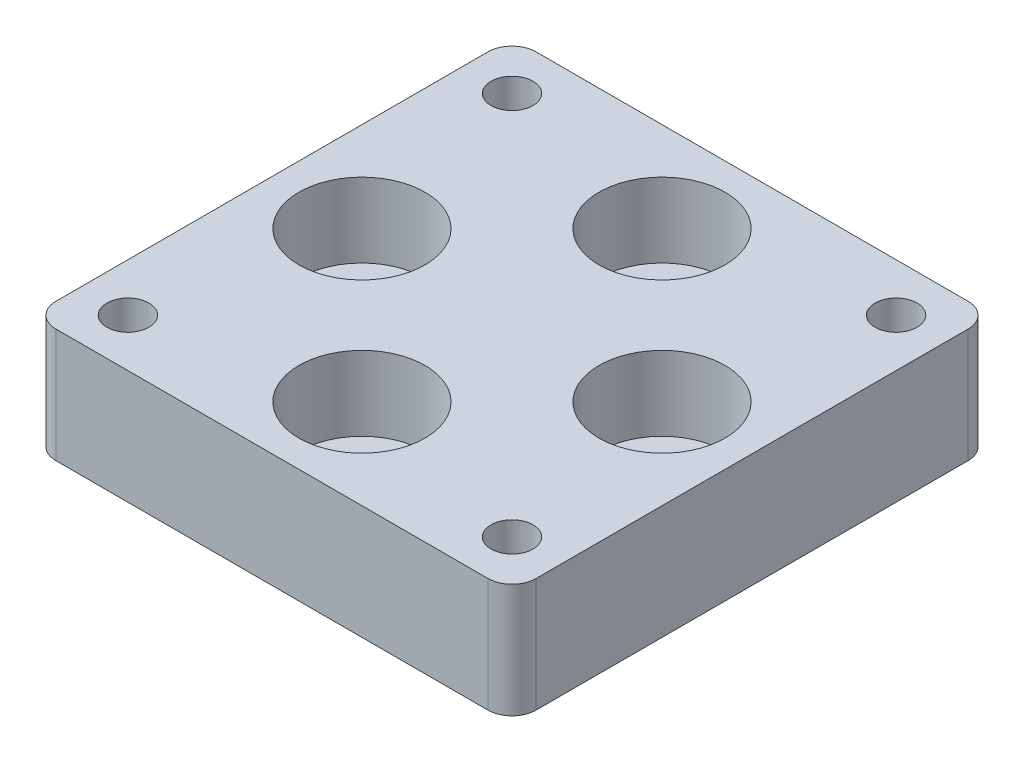
ISO-10303-21;
HEADER;
FILE_DESCRIPTION(('STEP AP214'),'2;1');
FILE_NAME('part.step','',(''),(''),'','','');
FILE_SCHEMA(('AUTOMOTIVE_DESIGN { 1 0 10303 214 1 1 1 1 }'));
ENDSEC;
DATA;
#1=APPLICATION_CONTEXT('core data for automotive mechanical design processes');
#2=APPLICATION_PROTOCOL_DEFINITION('international standard','automotive_design',2000,#1);
#3=PRODUCT_CONTEXT('',#1,'mechanical');
#4=PRODUCT('Part','Part','',(#3));
#5=PRODUCT_RELATED_PRODUCT_CATEGORY('part','',(#4));
#6=PRODUCT_DEFINITION_FORMATION('','',#4);
#7=PRODUCT_DEFINITION_CONTEXT('part definition',#1,'design');
#8=PRODUCT_DEFINITION('design','',#6,#7);
#9=PRODUCT_DEFINITION_SHAPE('','',#8);
#10=(LENGTH_UNIT() NAMED_UNIT(*) SI_UNIT(.MILLI.,.METRE.));
#11=(NAMED_UNIT(*) PLANE_ANGLE_UNIT() SI_UNIT($,.RADIAN.));
#12=(NAMED_UNIT(*) SI_UNIT($,.STERADIAN.) SOLID_ANGLE_UNIT());
#13=UNCERTAINTY_MEASURE_WITH_UNIT(LENGTH_MEASURE(1.E-05),#10,'distance_accuracy_value','');
#14=(GEOMETRIC_REPRESENTATION_CONTEXT(3) GLOBAL_UNCERTAINTY_ASSIGNED_CONTEXT((#13)) GLOBAL_UNIT_ASSIGNED_CONTEXT((#10,
#11,#12)) REPRESENTATION_CONTEXT('',''));
#15=CARTESIAN_POINT('',(0.,0.,0.));
#16=DIRECTION('',(0.,0.,1.));
#17=DIRECTION('',(1.,0.,0.));
#18=AXIS2_PLACEMENT_3D('',#15,#16,#17);
#19=CARTESIAN_POINT('',(-12.5,9.5,0.));
#20=DIRECTION('',(0.,-1.,0.));
#21=DIRECTION('',(0.,0.,-1.));
#22=AXIS2_PLACEMENT_3D('',#19,#20,#21);
#23=CYLINDRICAL_SURFACE('',#22,3.1);
#24=CARTESIAN_POINT('',(-12.5,0.,0.));
#25=DIRECTION('',(0.,1.,0.));
#26=DIRECTION('',(0.,0.,1.));
#27=AXIS2_PLACEMENT_3D('',#24,#25,#26);
#28=CIRCLE('',#27,3.1);
#29=CARTESIAN_POINT('',(-12.5,0.,3.1));
#30=VERTEX_POINT('',#29);
#31=EDGE_CURVE('E138',#30,#30,#28,.T.);
#32=ORIENTED_EDGE('',*,*,#31,.F.);
#33=EDGE_LOOP('',(#32));
#34=FACE_BOUND('',#33,.T.);
#35=CARTESIAN_POINT('',(-12.5,3.3,0.));
#36=DIRECTION('',(0.,1.,0.));
#37=DIRECTION('',(0.,0.,1.));
#38=AXIS2_PLACEMENT_3D('',#35,#36,#37);
#39=CIRCLE('',#38,3.1);
#40=CARTESIAN_POINT('',(-12.5,3.3,3.1));
#41=VERTEX_POINT('',#40);
#42=EDGE_CURVE('E41',#41,#41,#39,.T.);
#43=ORIENTED_EDGE('',*,*,#42,.T.);
#44=EDGE_LOOP('',(#43));
#45=FACE_BOUND('',#44,.T.);
#46=ADVANCED_FACE('F37',(#34,#45),#23,.F.);
#47=CARTESIAN_POINT('',(12.5,9.5,0.));
#48=DIRECTION('',(0.,-1.,0.));
#49=DIRECTION('',(0.,0.,-1.));
#50=AXIS2_PLACEMENT_3D('',#47,#48,#49);
#51=CYLINDRICAL_SURFACE('',#50,3.1);
#52=CARTESIAN_POINT('',(12.5,0.,0.));
#53=DIRECTION('',(0.,1.,0.));
#54=DIRECTION('',(0.,0.,-1.));
#55=AXIS2_PLACEMENT_3D('',#52,#53,#54);
#56=CIRCLE('',#55,3.1);
#57=CARTESIAN_POINT('',(12.5,0.,-3.1));
#58=VERTEX_POINT('',#57);
#59=EDGE_CURVE('E213',#58,#58,#56,.T.);
#60=ORIENTED_EDGE('',*,*,#59,.F.);
#61=EDGE_LOOP('',(#60));
#62=FACE_BOUND('',#61,.T.);
#63=CARTESIAN_POINT('',(12.5,3.3,0.));
#64=DIRECTION('',(0.,1.,0.));
#65=DIRECTION('',(0.,0.,1.));
#66=AXIS2_PLACEMENT_3D('',#63,#64,#65);
#67=CIRCLE('',#66,3.1);
#68=CARTESIAN_POINT('',(12.5,3.3,3.1));
#69=VERTEX_POINT('',#68);
#70=EDGE_CURVE('E172',#69,#69,#67,.T.);
#71=ORIENTED_EDGE('',*,*,#70,.T.);
#72=EDGE_LOOP('',(#71));
#73=FACE_BOUND('',#72,.T.);
#74=ADVANCED_FACE('F255',(#62,#73),#51,.F.);
#75=CARTESIAN_POINT('',(0.,9.5,-12.5));
#76=DIRECTION('',(0.,-1.,0.));
#77=DIRECTION('',(0.,0.,-1.));
#78=AXIS2_PLACEMENT_3D('',#75,#76,#77);
#79=CYLINDRICAL_SURFACE('',#78,3.1);
#80=CARTESIAN_POINT('',(0.,0.,-12.5));
#81=DIRECTION('',(0.,1.,0.));
#82=DIRECTION('',(0.,0.,1.));
#83=AXIS2_PLACEMENT_3D('',#80,#81,#82);
#84=CIRCLE('',#83,3.1);
#85=CARTESIAN_POINT('',(0.,0.,-9.4));
#86=VERTEX_POINT('',#85);
#87=EDGE_CURVE('E193',#86,#86,#84,.T.);
#88=ORIENTED_EDGE('',*,*,#87,.F.);
#89=EDGE_LOOP('',(#88));
#90=FACE_BOUND('',#89,.T.);
#91=CARTESIAN_POINT('',(0.,3.3,-12.5));
#92=DIRECTION('',(0.,1.,0.));
#93=DIRECTION('',(0.,0.,1.));
#94=AXIS2_PLACEMENT_3D('',#91,#92,#93);
#95=CIRCLE('',#94,3.1);
#96=CARTESIAN_POINT('',(0.,3.3,-9.4));
#97=VERTEX_POINT('',#96);
#98=EDGE_CURVE('E169',#97,#97,#95,.T.);
#99=ORIENTED_EDGE('',*,*,#98,.T.);
#100=EDGE_LOOP('',(#99));
#101=FACE_BOUND('',#100,.T.);
#102=ADVANCED_FACE('F261',(#90,#101),#79,.F.);
#103=CARTESIAN_POINT('',(0.,9.5,12.5));
#104=DIRECTION('',(0.,-1.,0.));
#105=DIRECTION('',(0.,0.,-1.));
#106=AXIS2_PLACEMENT_3D('',#103,#104,#105);
#107=CYLINDRICAL_SURFACE('',#106,3.1);
#108=CARTESIAN_POINT('',(0.,0.,12.5));
#109=DIRECTION('',(0.,1.,0.));
#110=DIRECTION('',(0.,0.,-1.));
#111=AXIS2_PLACEMENT_3D('',#108,#109,#110);
#112=CIRCLE('',#111,3.1);
#113=CARTESIAN_POINT('',(0.,0.,9.4));
#114=VERTEX_POINT('',#113);
#115=EDGE_CURVE('E177',#114,#114,#112,.T.);
#116=ORIENTED_EDGE('',*,*,#115,.F.);
#117=EDGE_LOOP('',(#116));
#118=FACE_BOUND('',#117,.T.);
#119=CARTESIAN_POINT('',(0.,3.3,12.5));
#120=DIRECTION('',(0.,1.,0.));
#121=DIRECTION('',(0.,0.,1.));
#122=AXIS2_PLACEMENT_3D('',#119,#120,#121);
#123=CIRCLE('',#122,3.1);
#124=CARTESIAN_POINT('',(0.,3.3,15.6));
#125=VERTEX_POINT('',#124);
#126=EDGE_CURVE('E166',#125,#125,#123,.T.);
#127=ORIENTED_EDGE('',*,*,#126,.T.);
#128=EDGE_LOOP('',(#127));
#129=FACE_BOUND('',#128,.T.);
#130=ADVANCED_FACE('F269',(#118,#129),#107,.F.);
#131=CARTESIAN_POINT('',(0.,9.5,0.));
#132=DIRECTION('',(0.,-1.,0.));
#133=DIRECTION('',(0.,0.,-1.));
#134=AXIS2_PLACEMENT_3D('',#131,#132,#133);
#135=PLANE('',#134);
#136=CARTESIAN_POINT('',(0.,9.5,-12.5));
#137=DIRECTION('',(0.,1.,0.));
#138=DIRECTION('',(0.,0.,1.));
#139=AXIS2_PLACEMENT_3D('',#136,#137,#138);
#140=CIRCLE('',#139,5.25);
#141=CARTESIAN_POINT('',(0.,9.5,-7.25));
#142=VERTEX_POINT('',#141);
#143=EDGE_CURVE('E455',#142,#142,#140,.T.);
#144=ORIENTED_EDGE('',*,*,#143,.F.);
#145=EDGE_LOOP('',(#144));
#146=FACE_BOUND('',#145,.T.);
#147=CARTESIAN_POINT('',(12.5,9.5,0.));
#148=DIRECTION('',(0.,1.,0.));
#149=DIRECTION('',(0.,0.,1.));
#150=AXIS2_PLACEMENT_3D('',#147,#148,#149);
#151=CIRCLE('',#150,5.25);
#152=CARTESIAN_POINT('',(12.5,9.5,5.25));
#153=VERTEX_POINT('',#152);
#154=EDGE_CURVE('E463',#153,#153,#151,.T.);
#155=ORIENTED_EDGE('',*,*,#154,.F.);
#156=EDGE_LOOP('',(#155));
#157=FACE_BOUND('',#156,.T.);
#158=CARTESIAN_POINT('',(0.,9.5,12.5));
#159=DIRECTION('',(0.,1.,0.));
#160=DIRECTION('',(0.,0.,1.));
#161=AXIS2_PLACEMENT_3D('',#158,#159,#160);
#162=CIRCLE('',#161,5.25);
#163=CARTESIAN_POINT('',(0.,9.5,17.75));
#164=VERTEX_POINT('',#163);
#165=EDGE_CURVE('E469',#164,#164,#162,.T.);
#166=ORIENTED_EDGE('',*,*,#165,.F.);
#167=EDGE_LOOP('',(#166));
#168=FACE_BOUND('',#167,.T.);
#169=CARTESIAN_POINT('',(-12.5,9.5,0.));
#170=DIRECTION('',(0.,1.,0.));
#171=DIRECTION('',(0.,0.,1.));
#172=AXIS2_PLACEMENT_3D('',#169,#170,#171);
#173=CIRCLE('',#172,5.25);
#174=CARTESIAN_POINT('',(-12.5,9.5,5.25));
#175=VERTEX_POINT('',#174);
#176=EDGE_CURVE('E190',#175,#175,#173,.T.);
#177=ORIENTED_EDGE('',*,*,#176,.F.);
#178=EDGE_LOOP('',(#177));
#179=FACE_BOUND('',#178,.T.);
#180=DIRECTION('',(0.,0.,-1.));
#181=VECTOR('',#180,1.);
#182=CARTESIAN_POINT('',(20.,9.5,20.));
#183=LINE('',#182,#181);
#184=CARTESIAN_POINT('',(20.,9.5,18.));
#185=VERTEX_POINT('',#184);
#186=CARTESIAN_POINT('',(20.,9.5,-18.));
#187=VERTEX_POINT('',#186);
#188=EDGE_CURVE('E143',#185,#187,#183,.T.);
#189=ORIENTED_EDGE('',*,*,#188,.T.);
#190=CARTESIAN_POINT('',(18.,9.5,-18.));
#191=DIRECTION('',(0.,-1.,0.));
#192=DIRECTION('',(0.,0.,-1.));
#193=AXIS2_PLACEMENT_3D('',#190,#191,#192);
#194=CIRCLE('',#193,2.);
#195=CARTESIAN_POINT('',(18.,9.5,-20.));
#196=VERTEX_POINT('',#195);
#197=EDGE_CURVE('E158',#187,#196,#194,.F.);
#198=ORIENTED_EDGE('',*,*,#197,.T.);
#199=DIRECTION('',(-1.,0.,0.));
#200=VECTOR('',#199,1.);
#201=CARTESIAN_POINT('',(-20.,9.5,-20.));
#202=LINE('',#201,#200);
#203=CARTESIAN_POINT('',(-18.,9.5,-20.));
#204=VERTEX_POINT('',#203);
#205=EDGE_CURVE('E125',#196,#204,#202,.T.);
#206=ORIENTED_EDGE('',*,*,#205,.T.);
#207=CARTESIAN_POINT('',(-18.,9.5,-18.));
#208=DIRECTION('',(0.,-1.,0.));
#209=DIRECTION('',(0.,0.,-1.));
#210=AXIS2_PLACEMENT_3D('',#207,#208,#209);
#211=CIRCLE('',#210,2.);
#212=CARTESIAN_POINT('',(-20.,9.5,-18.));
#213=VERTEX_POINT('',#212);
#214=EDGE_CURVE('E153',#204,#213,#211,.F.);
#215=ORIENTED_EDGE('',*,*,#214,.T.);
#216=DIRECTION('',(0.,0.,1.));
#217=VECTOR('',#216,1.);
#218=CARTESIAN_POINT('',(-20.,9.5,20.));
#219=LINE('',#218,#217);
#220=CARTESIAN_POINT('',(-20.,9.5,18.));
#221=VERTEX_POINT('',#220);
#222=EDGE_CURVE('E223',#213,#221,#219,.T.);
#223=ORIENTED_EDGE('',*,*,#222,.T.);
#224=CARTESIAN_POINT('',(-18.,9.5,18.));
#225=DIRECTION('',(0.,-1.,0.));
#226=DIRECTION('',(0.,0.,-1.));
#227=AXIS2_PLACEMENT_3D('',#224,#225,#226);
#228=CIRCLE('',#227,2.);
#229=CARTESIAN_POINT('',(-18.,9.5,20.));
#230=VERTEX_POINT('',#229);
#231=EDGE_CURVE('E61',#221,#230,#228,.F.);
#232=ORIENTED_EDGE('',*,*,#231,.T.);
#233=DIRECTION('',(1.,0.,0.));
#234=VECTOR('',#233,1.);
#235=CARTESIAN_POINT('',(-20.,9.5,20.));
#236=LINE('',#235,#234);
#237=CARTESIAN_POINT('',(18.,9.5,20.));
#238=VERTEX_POINT('',#237);
#239=EDGE_CURVE('E144',#230,#238,#236,.T.);
#240=ORIENTED_EDGE('',*,*,#239,.T.);
#241=CARTESIAN_POINT('',(18.,9.5,18.));
#242=DIRECTION('',(0.,-1.,0.));
#243=DIRECTION('',(0.,0.,-1.));
#244=AXIS2_PLACEMENT_3D('',#241,#242,#243);
#245=CIRCLE('',#244,2.);
#246=EDGE_CURVE('E156',#238,#185,#245,.F.);
#247=ORIENTED_EDGE('',*,*,#246,.T.);
#248=EDGE_LOOP('',(#189,#198,#206,#215,#223,#232,#240,#247));
#249=FACE_BOUND('',#248,.T.);
#250=CARTESIAN_POINT('',(-16.,9.5,-16.));
#251=DIRECTION('',(0.,1.,0.));
#252=DIRECTION('',(0.,0.,1.));
#253=AXIS2_PLACEMENT_3D('',#250,#251,#252);
#254=CIRCLE('',#253,1.75);
#255=CARTESIAN_POINT('',(-16.,9.5,-14.25));
#256=VERTEX_POINT('',#255);
#257=EDGE_CURVE('E210',#256,#256,#254,.T.);
#258=ORIENTED_EDGE('',*,*,#257,.F.);
#259=EDGE_LOOP('',(#258));
#260=FACE_BOUND('',#259,.T.);
#261=CARTESIAN_POINT('',(16.,9.5,-16.));
#262=DIRECTION('',(0.,1.,0.));
#263=DIRECTION('',(0.,0.,1.));
#264=AXIS2_PLACEMENT_3D('',#261,#262,#263);
#265=CIRCLE('',#264,1.75);
#266=CARTESIAN_POINT('',(16.,9.5,-14.25));
#267=VERTEX_POINT('',#266);
#268=EDGE_CURVE('E204',#267,#267,#265,.T.);
#269=ORIENTED_EDGE('',*,*,#268,.F.);
#270=EDGE_LOOP('',(#269));
#271=FACE_BOUND('',#270,.T.);
#272=CARTESIAN_POINT('',(-16.,9.5,16.));
#273=DIRECTION('',(0.,1.,0.));
#274=DIRECTION('',(0.,0.,1.));
#275=AXIS2_PLACEMENT_3D('',#272,#273,#274);
#276=CIRCLE('',#275,1.75);
#277=CARTESIAN_POINT('',(-16.,9.5,17.75));
#278=VERTEX_POINT('',#277);
#279=EDGE_CURVE('E198',#278,#278,#276,.T.);
#280=ORIENTED_EDGE('',*,*,#279,.F.);
#281=EDGE_LOOP('',(#280));
#282=FACE_BOUND('',#281,.T.);
#283=CARTESIAN_POINT('',(16.,9.5,16.));
#284=DIRECTION('',(0.,1.,0.));
#285=DIRECTION('',(0.,0.,1.));
#286=AXIS2_PLACEMENT_3D('',#283,#284,#285);
#287=CIRCLE('',#286,1.75);
#288=CARTESIAN_POINT('',(16.,9.5,17.75));
#289=VERTEX_POINT('',#288);
#290=EDGE_CURVE('E186',#289,#289,#287,.T.);
#291=ORIENTED_EDGE('',*,*,#290,.F.);
#292=EDGE_LOOP('',(#291));
#293=FACE_BOUND('',#292,.T.);
#294=ADVANCED_FACE('F225',(#146,#157,#168,#179,#249,#260,#271,#282,#293),#135,.F.);
#295=CARTESIAN_POINT('',(0.,0.,0.));
#296=DIRECTION('',(0.,-1.,0.));
#297=DIRECTION('',(0.,0.,-1.));
#298=AXIS2_PLACEMENT_3D('',#295,#296,#297);
#299=PLANE('',#298);
#300=CARTESIAN_POINT('',(16.,0.,16.));
#301=DIRECTION('',(0.,1.,0.));
#302=DIRECTION('',(0.,0.,1.));
#303=AXIS2_PLACEMENT_3D('',#300,#301,#302);
#304=CIRCLE('',#303,1.75);
#305=CARTESIAN_POINT('',(16.,0.,17.75));
#306=VERTEX_POINT('',#305);
#307=EDGE_CURVE('E181',#306,#306,#304,.T.);
#308=ORIENTED_EDGE('',*,*,#307,.T.);
#309=EDGE_LOOP('',(#308));
#310=FACE_BOUND('',#309,.T.);
#311=CARTESIAN_POINT('',(-16.,0.,16.));
#312=DIRECTION('',(0.,1.,0.));
#313=DIRECTION('',(0.,0.,1.));
#314=AXIS2_PLACEMENT_3D('',#311,#312,#313);
#315=CIRCLE('',#314,1.75);
#316=CARTESIAN_POINT('',(-16.,0.,17.75));
#317=VERTEX_POINT('',#316);
#318=EDGE_CURVE('E197',#317,#317,#315,.T.);
#319=ORIENTED_EDGE('',*,*,#318,.T.);
#320=EDGE_LOOP('',(#319));
#321=FACE_BOUND('',#320,.T.);
#322=CARTESIAN_POINT('',(-16.,0.,-16.));
#323=DIRECTION('',(0.,1.,0.));
#324=DIRECTION('',(0.,0.,1.));
#325=AXIS2_PLACEMENT_3D('',#322,#323,#324);
#326=CIRCLE('',#325,1.75);
#327=CARTESIAN_POINT('',(-16.,0.,-14.25));
#328=VERTEX_POINT('',#327);
#329=EDGE_CURVE('E207',#328,#328,#326,.T.);
#330=ORIENTED_EDGE('',*,*,#329,.T.);
#331=EDGE_LOOP('',(#330));
#332=FACE_BOUND('',#331,.T.);
#333=ORIENTED_EDGE('',*,*,#31,.T.);
#334=EDGE_LOOP('',(#333));
#335=FACE_BOUND('',#334,.T.);
#336=DIRECTION('',(-1.,0.,0.));
#337=VECTOR('',#336,1.);
#338=CARTESIAN_POINT('',(-20.,0.,-20.));
#339=LINE('',#338,#337);
#340=CARTESIAN_POINT('',(18.,0.,-20.));
#341=VERTEX_POINT('',#340);
#342=CARTESIAN_POINT('',(-18.,0.,-20.));
#343=VERTEX_POINT('',#342);
#344=EDGE_CURVE('E122',#341,#343,#339,.T.);
#345=ORIENTED_EDGE('',*,*,#344,.F.);
#346=CARTESIAN_POINT('',(18.,0.,-18.));
#347=DIRECTION('',(0.,-1.,0.));
#348=DIRECTION('',(0.,0.,-1.));
#349=AXIS2_PLACEMENT_3D('',#346,#347,#348);
#350=CIRCLE('',#349,2.);
#351=CARTESIAN_POINT('',(20.,0.,-18.));
#352=VERTEX_POINT('',#351);
#353=EDGE_CURVE('E105',#341,#352,#350,.T.);
#354=ORIENTED_EDGE('',*,*,#353,.T.);
#355=DIRECTION('',(0.,0.,-1.));
#356=VECTOR('',#355,1.);
#357=CARTESIAN_POINT('',(20.,0.,20.));
#358=LINE('',#357,#356);
#359=CARTESIAN_POINT('',(20.,0.,18.));
#360=VERTEX_POINT('',#359);
#361=EDGE_CURVE('E133',#360,#352,#358,.T.);
#362=ORIENTED_EDGE('',*,*,#361,.F.);
#363=CARTESIAN_POINT('',(18.,0.,18.));
#364=DIRECTION('',(0.,-1.,0.));
#365=DIRECTION('',(0.,0.,-1.));
#366=AXIS2_PLACEMENT_3D('',#363,#364,#365);
#367=CIRCLE('',#366,2.);
#368=CARTESIAN_POINT('',(18.,0.,20.));
#369=VERTEX_POINT('',#368);
#370=EDGE_CURVE('E116',#360,#369,#367,.T.);
#371=ORIENTED_EDGE('',*,*,#370,.T.);
#372=DIRECTION('',(1.,0.,0.));
#373=VECTOR('',#372,1.);
#374=CARTESIAN_POINT('',(-20.,0.,20.));
#375=LINE('',#374,#373);
#376=CARTESIAN_POINT('',(-18.,0.,20.));
#377=VERTEX_POINT('',#376);
#378=EDGE_CURVE('E136',#377,#369,#375,.T.);
#379=ORIENTED_EDGE('',*,*,#378,.F.);
#380=CARTESIAN_POINT('',(-18.,0.,18.));
#381=DIRECTION('',(0.,-1.,0.));
#382=DIRECTION('',(0.,0.,-1.));
#383=AXIS2_PLACEMENT_3D('',#380,#381,#382);
#384=CIRCLE('',#383,2.);
#385=CARTESIAN_POINT('',(-20.,0.,18.));
#386=VERTEX_POINT('',#385);
#387=EDGE_CURVE('E147',#377,#386,#384,.T.);
#388=ORIENTED_EDGE('',*,*,#387,.T.);
#389=DIRECTION('',(0.,0.,1.));
#390=VECTOR('',#389,1.);
#391=CARTESIAN_POINT('',(-20.,0.,20.));
#392=LINE('',#391,#390);
#393=CARTESIAN_POINT('',(-20.,0.,-18.));
#394=VERTEX_POINT('',#393);
#395=EDGE_CURVE('E132',#394,#386,#392,.T.);
#396=ORIENTED_EDGE('',*,*,#395,.F.);
#397=CARTESIAN_POINT('',(-18.,0.,-18.));
#398=DIRECTION('',(0.,-1.,0.));
#399=DIRECTION('',(0.,0.,-1.));
#400=AXIS2_PLACEMENT_3D('',#397,#398,#399);
#401=CIRCLE('',#400,2.);
#402=EDGE_CURVE('E126',#394,#343,#401,.T.);
#403=ORIENTED_EDGE('',*,*,#402,.T.);
#404=EDGE_LOOP('',(#345,#354,#362,#371,#379,#388,#396,#403));
#405=FACE_BOUND('',#404,.T.);
#406=ORIENTED_EDGE('',*,*,#59,.T.);
#407=EDGE_LOOP('',(#406));
#408=FACE_BOUND('',#407,.T.);
#409=CARTESIAN_POINT('',(16.,0.,-16.));
#410=DIRECTION('',(0.,1.,0.));
#411=DIRECTION('',(0.,0.,1.));
#412=AXIS2_PLACEMENT_3D('',#409,#410,#411);
#413=CIRCLE('',#412,1.75);
#414=CARTESIAN_POINT('',(16.,0.,-14.25));
#415=VERTEX_POINT('',#414);
#416=EDGE_CURVE('E201',#415,#415,#413,.T.);
#417=ORIENTED_EDGE('',*,*,#416,.T.);
#418=EDGE_LOOP('',(#417));
#419=FACE_BOUND('',#418,.T.);
#420=ORIENTED_EDGE('',*,*,#87,.T.);
#421=EDGE_LOOP('',(#420));
#422=FACE_BOUND('',#421,.T.);
#423=ORIENTED_EDGE('',*,*,#115,.T.);
#424=EDGE_LOOP('',(#423));
#425=FACE_BOUND('',#424,.T.);
#426=ADVANCED_FACE('F129',(#310,#321,#332,#335,#405,#408,#419,#422,#425),#299,.T.);
#427=CARTESIAN_POINT('',(20.,9.5,20.));
#428=DIRECTION('',(-1.,0.,0.));
#429=DIRECTION('',(0.,0.,1.));
#430=AXIS2_PLACEMENT_3D('',#427,#428,#429);
#431=PLANE('',#430);
#432=ORIENTED_EDGE('',*,*,#361,.T.);
#433=DIRECTION('',(0.,-1.,0.));
#434=VECTOR('',#433,1.);
#435=CARTESIAN_POINT('',(20.,9.5,-18.));
#436=LINE('',#435,#434);
#437=EDGE_CURVE('E110',#352,#187,#436,.F.);
#438=ORIENTED_EDGE('',*,*,#437,.T.);
#439=ORIENTED_EDGE('',*,*,#188,.F.);
#440=DIRECTION('',(0.,-1.,0.));
#441=VECTOR('',#440,1.);
#442=CARTESIAN_POINT('',(20.,9.5,18.));
#443=LINE('',#442,#441);
#444=EDGE_CURVE('E115',#185,#360,#443,.T.);
#445=ORIENTED_EDGE('',*,*,#444,.T.);
#446=EDGE_LOOP('',(#432,#438,#439,#445));
#447=FACE_BOUND('',#446,.T.);
#448=ADVANCED_FACE('F233',(#447),#431,.F.);
#449=CARTESIAN_POINT('',(-20.,9.5,-20.));
#450=DIRECTION('',(0.,0.,1.));
#451=DIRECTION('',(1.,0.,0.));
#452=AXIS2_PLACEMENT_3D('',#449,#450,#451);
#453=PLANE('',#452);
#454=ORIENTED_EDGE('',*,*,#205,.F.);
#455=DIRECTION('',(0.,-1.,0.));
#456=VECTOR('',#455,1.);
#457=CARTESIAN_POINT('',(18.,9.5,-20.));
#458=LINE('',#457,#456);
#459=EDGE_CURVE('E109',#196,#341,#458,.T.);
#460=ORIENTED_EDGE('',*,*,#459,.T.);
#461=ORIENTED_EDGE('',*,*,#344,.T.);
#462=DIRECTION('',(0.,-1.,0.));
#463=VECTOR('',#462,1.);
#464=CARTESIAN_POINT('',(-18.,9.5,-20.));
#465=LINE('',#464,#463);
#466=EDGE_CURVE('E127',#343,#204,#465,.F.);
#467=ORIENTED_EDGE('',*,*,#466,.T.);
#468=EDGE_LOOP('',(#454,#460,#461,#467));
#469=FACE_BOUND('',#468,.T.);
#470=ADVANCED_FACE('F121',(#469),#453,.F.);
#471=CARTESIAN_POINT('',(-20.,9.5,20.));
#472=DIRECTION('',(1.,0.,0.));
#473=DIRECTION('',(0.,0.,-1.));
#474=AXIS2_PLACEMENT_3D('',#471,#472,#473);
#475=PLANE('',#474);
#476=ORIENTED_EDGE('',*,*,#395,.T.);
#477=DIRECTION('',(0.,-1.,0.));
#478=VECTOR('',#477,1.);
#479=CARTESIAN_POINT('',(-20.,9.5,18.));
#480=LINE('',#479,#478);
#481=EDGE_CURVE('E11',#386,#221,#480,.F.);
#482=ORIENTED_EDGE('',*,*,#481,.T.);
#483=ORIENTED_EDGE('',*,*,#222,.F.);
#484=DIRECTION('',(0.,-1.,0.));
#485=VECTOR('',#484,1.);
#486=CARTESIAN_POINT('',(-20.,9.5,-18.));
#487=LINE('',#486,#485);
#488=EDGE_CURVE('E46',#213,#394,#487,.T.);
#489=ORIENTED_EDGE('',*,*,#488,.T.);
#490=EDGE_LOOP('',(#476,#482,#483,#489));
#491=FACE_BOUND('',#490,.T.);
#492=ADVANCED_FACE('F240',(#491),#475,.F.);
#493=CARTESIAN_POINT('',(-20.,9.5,20.));
#494=DIRECTION('',(0.,0.,-1.));
#495=DIRECTION('',(-1.,0.,0.));
#496=AXIS2_PLACEMENT_3D('',#493,#494,#495);
#497=PLANE('',#496);
#498=ORIENTED_EDGE('',*,*,#378,.T.);
#499=DIRECTION('',(0.,-1.,0.));
#500=VECTOR('',#499,1.);
#501=CARTESIAN_POINT('',(18.,9.5,20.));
#502=LINE('',#501,#500);
#503=EDGE_CURVE('E54',#369,#238,#502,.F.);
#504=ORIENTED_EDGE('',*,*,#503,.T.);
#505=ORIENTED_EDGE('',*,*,#239,.F.);
#506=DIRECTION('',(0.,-1.,0.));
#507=VECTOR('',#506,1.);
#508=CARTESIAN_POINT('',(-18.,9.5,20.));
#509=LINE('',#508,#507);
#510=EDGE_CURVE('E160',#230,#377,#509,.T.);
#511=ORIENTED_EDGE('',*,*,#510,.T.);
#512=EDGE_LOOP('',(#498,#504,#505,#511));
#513=FACE_BOUND('',#512,.T.);
#514=ADVANCED_FACE('F235',(#513),#497,.F.);
#515=CARTESIAN_POINT('',(-16.,9.5,-16.));
#516=DIRECTION('',(0.,-1.,0.));
#517=DIRECTION('',(0.,0.,-1.));
#518=AXIS2_PLACEMENT_3D('',#515,#516,#517);
#519=CYLINDRICAL_SURFACE('',#518,1.75);
#520=ORIENTED_EDGE('',*,*,#257,.T.);
#521=EDGE_LOOP('',(#520));
#522=FACE_BOUND('',#521,.T.);
#523=ORIENTED_EDGE('',*,*,#329,.F.);
#524=EDGE_LOOP('',(#523));
#525=FACE_BOUND('',#524,.T.);
#526=ADVANCED_FACE('F276',(#522,#525),#519,.F.);
#527=CARTESIAN_POINT('',(16.,9.5,-16.));
#528=DIRECTION('',(0.,-1.,0.));
#529=DIRECTION('',(0.,0.,-1.));
#530=AXIS2_PLACEMENT_3D('',#527,#528,#529);
#531=CYLINDRICAL_SURFACE('',#530,1.75);
#532=ORIENTED_EDGE('',*,*,#268,.T.);
#533=EDGE_LOOP('',(#532));
#534=FACE_BOUND('',#533,.T.);
#535=ORIENTED_EDGE('',*,*,#416,.F.);
#536=EDGE_LOOP('',(#535));
#537=FACE_BOUND('',#536,.T.);
#538=ADVANCED_FACE('F421',(#534,#537),#531,.F.);
#539=CARTESIAN_POINT('',(-16.,9.5,16.));
#540=DIRECTION('',(0.,-1.,0.));
#541=DIRECTION('',(0.,0.,-1.));
#542=AXIS2_PLACEMENT_3D('',#539,#540,#541);
#543=CYLINDRICAL_SURFACE('',#542,1.75);
#544=ORIENTED_EDGE('',*,*,#279,.T.);
#545=EDGE_LOOP('',(#544));
#546=FACE_BOUND('',#545,.T.);
#547=ORIENTED_EDGE('',*,*,#318,.F.);
#548=EDGE_LOOP('',(#547));
#549=FACE_BOUND('',#548,.T.);
#550=ADVANCED_FACE('F416',(#546,#549),#543,.F.);
#551=CARTESIAN_POINT('',(16.,9.5,16.));
#552=DIRECTION('',(0.,-1.,0.));
#553=DIRECTION('',(0.,0.,-1.));
#554=AXIS2_PLACEMENT_3D('',#551,#552,#553);
#555=CYLINDRICAL_SURFACE('',#554,1.75);
#556=ORIENTED_EDGE('',*,*,#290,.T.);
#557=EDGE_LOOP('',(#556));
#558=FACE_BOUND('',#557,.T.);
#559=ORIENTED_EDGE('',*,*,#307,.F.);
#560=EDGE_LOOP('',(#559));
#561=FACE_BOUND('',#560,.T.);
#562=ADVANCED_FACE('F285',(#558,#561),#555,.F.);
#563=CARTESIAN_POINT('',(18.,9.5,-18.));
#564=DIRECTION('',(0.,-1.,0.));
#565=DIRECTION('',(0.,0.,-1.));
#566=AXIS2_PLACEMENT_3D('',#563,#564,#565);
#567=CYLINDRICAL_SURFACE('',#566,2.);
#568=ORIENTED_EDGE('',*,*,#197,.F.);
#569=ORIENTED_EDGE('',*,*,#437,.F.);
#570=ORIENTED_EDGE('',*,*,#353,.F.);
#571=ORIENTED_EDGE('',*,*,#459,.F.);
#572=EDGE_LOOP('',(#568,#569,#570,#571));
#573=FACE_BOUND('',#572,.T.);
#574=ADVANCED_FACE('F108',(#573),#567,.T.);
#575=CARTESIAN_POINT('',(18.,9.5,18.));
#576=DIRECTION('',(0.,-1.,0.));
#577=DIRECTION('',(0.,0.,-1.));
#578=AXIS2_PLACEMENT_3D('',#575,#576,#577);
#579=CYLINDRICAL_SURFACE('',#578,2.);
#580=ORIENTED_EDGE('',*,*,#246,.F.);
#581=ORIENTED_EDGE('',*,*,#503,.F.);
#582=ORIENTED_EDGE('',*,*,#370,.F.);
#583=ORIENTED_EDGE('',*,*,#444,.F.);
#584=EDGE_LOOP('',(#580,#581,#582,#583));
#585=FACE_BOUND('',#584,.T.);
#586=ADVANCED_FACE('F231',(#585),#579,.T.);
#587=CARTESIAN_POINT('',(-18.,9.5,18.));
#588=DIRECTION('',(0.,-1.,0.));
#589=DIRECTION('',(0.,0.,-1.));
#590=AXIS2_PLACEMENT_3D('',#587,#588,#589);
#591=CYLINDRICAL_SURFACE('',#590,2.);
#592=ORIENTED_EDGE('',*,*,#231,.F.);
#593=ORIENTED_EDGE('',*,*,#481,.F.);
#594=ORIENTED_EDGE('',*,*,#387,.F.);
#595=ORIENTED_EDGE('',*,*,#510,.F.);
#596=EDGE_LOOP('',(#592,#593,#594,#595));
#597=FACE_BOUND('',#596,.T.);
#598=ADVANCED_FACE('F237',(#597),#591,.T.);
#599=CARTESIAN_POINT('',(-18.,9.5,-18.));
#600=DIRECTION('',(0.,-1.,0.));
#601=DIRECTION('',(0.,0.,-1.));
#602=AXIS2_PLACEMENT_3D('',#599,#600,#601);
#603=CYLINDRICAL_SURFACE('',#602,2.);
#604=ORIENTED_EDGE('',*,*,#214,.F.);
#605=ORIENTED_EDGE('',*,*,#466,.F.);
#606=ORIENTED_EDGE('',*,*,#402,.F.);
#607=ORIENTED_EDGE('',*,*,#488,.F.);
#608=EDGE_LOOP('',(#604,#605,#606,#607));
#609=FACE_BOUND('',#608,.T.);
#610=ADVANCED_FACE('F39',(#609),#603,.T.);
#611=CARTESIAN_POINT('',(0.,3.3,12.5));
#612=DIRECTION('',(0.,1.,0.));
#613=DIRECTION('',(0.,0.,1.));
#614=AXIS2_PLACEMENT_3D('',#611,#612,#613);
#615=CYLINDRICAL_SURFACE('',#614,5.25);
#616=CARTESIAN_POINT('',(0.,3.3,12.5));
#617=DIRECTION('',(0.,1.,0.));
#618=DIRECTION('',(0.,0.,1.));
#619=AXIS2_PLACEMENT_3D('',#616,#617,#618);
#620=CIRCLE('',#619,5.25);
#621=CARTESIAN_POINT('',(0.,3.3,17.75));
#622=VERTEX_POINT('',#621);
#623=EDGE_CURVE('E466',#622,#622,#620,.T.);
#624=ORIENTED_EDGE('',*,*,#623,.F.);
#625=EDGE_LOOP('',(#624));
#626=FACE_BOUND('',#625,.T.);
#627=ORIENTED_EDGE('',*,*,#165,.T.);
#628=EDGE_LOOP('',(#627));
#629=FACE_BOUND('',#628,.T.);
#630=ADVANCED_FACE('F246',(#626,#629),#615,.F.);
#631=CARTESIAN_POINT('',(0.,3.3,12.5));
#632=DIRECTION('',(0.,1.,0.));
#633=DIRECTION('',(0.,0.,1.));
#634=AXIS2_PLACEMENT_3D('',#631,#632,#633);
#635=PLANE('',#634);
#636=ORIENTED_EDGE('',*,*,#126,.F.);
#637=EDGE_LOOP('',(#636));
#638=FACE_BOUND('',#637,.T.);
#639=ORIENTED_EDGE('',*,*,#623,.T.);
#640=EDGE_LOOP('',(#639));
#641=FACE_BOUND('',#640,.T.);
#642=ADVANCED_FACE('F251',(#638,#641),#635,.T.);
#643=CARTESIAN_POINT('',(0.,3.3,-12.5));
#644=DIRECTION('',(0.,1.,0.));
#645=DIRECTION('',(0.,0.,1.));
#646=AXIS2_PLACEMENT_3D('',#643,#644,#645);
#647=CYLINDRICAL_SURFACE('',#646,5.25);
#648=CARTESIAN_POINT('',(0.,3.3,-12.5));
#649=DIRECTION('',(0.,1.,0.));
#650=DIRECTION('',(0.,0.,1.));
#651=AXIS2_PLACEMENT_3D('',#648,#649,#650);
#652=CIRCLE('',#651,5.25);
#653=CARTESIAN_POINT('',(0.,3.3,-7.25));
#654=VERTEX_POINT('',#653);
#655=EDGE_CURVE('E170',#654,#654,#652,.T.);
#656=ORIENTED_EDGE('',*,*,#655,.F.);
#657=EDGE_LOOP('',(#656));
#658=FACE_BOUND('',#657,.T.);
#659=ORIENTED_EDGE('',*,*,#143,.T.);
#660=EDGE_LOOP('',(#659));
#661=FACE_BOUND('',#660,.T.);
#662=ADVANCED_FACE('F350',(#658,#661),#647,.F.);
#663=CARTESIAN_POINT('',(0.,3.3,-12.5));
#664=DIRECTION('',(0.,1.,0.));
#665=DIRECTION('',(0.,0.,1.));
#666=AXIS2_PLACEMENT_3D('',#663,#664,#665);
#667=PLANE('',#666);
#668=ORIENTED_EDGE('',*,*,#98,.F.);
#669=EDGE_LOOP('',(#668));
#670=FACE_BOUND('',#669,.T.);
#671=ORIENTED_EDGE('',*,*,#655,.T.);
#672=EDGE_LOOP('',(#671));
#673=FACE_BOUND('',#672,.T.);
#674=ADVANCED_FACE('F360',(#670,#673),#667,.T.);
#675=CARTESIAN_POINT('',(12.5,3.3,0.));
#676=DIRECTION('',(0.,1.,0.));
#677=DIRECTION('',(0.,0.,1.));
#678=AXIS2_PLACEMENT_3D('',#675,#676,#677);
#679=CYLINDRICAL_SURFACE('',#678,5.25);
#680=CARTESIAN_POINT('',(12.5,3.3,0.));
#681=DIRECTION('',(0.,1.,0.));
#682=DIRECTION('',(0.,0.,1.));
#683=AXIS2_PLACEMENT_3D('',#680,#681,#682);
#684=CIRCLE('',#683,5.25);
#685=CARTESIAN_POINT('',(12.5,3.3,5.25));
#686=VERTEX_POINT('',#685);
#687=EDGE_CURVE('E458',#686,#686,#684,.T.);
#688=ORIENTED_EDGE('',*,*,#687,.F.);
#689=EDGE_LOOP('',(#688));
#690=FACE_BOUND('',#689,.T.);
#691=ORIENTED_EDGE('',*,*,#154,.T.);
#692=EDGE_LOOP('',(#691));
#693=FACE_BOUND('',#692,.T.);
#694=ADVANCED_FACE('F370',(#690,#693),#679,.F.);
#695=CARTESIAN_POINT('',(12.5,3.3,0.));
#696=DIRECTION('',(0.,1.,0.));
#697=DIRECTION('',(0.,0.,1.));
#698=AXIS2_PLACEMENT_3D('',#695,#696,#697);
#699=PLANE('',#698);
#700=ORIENTED_EDGE('',*,*,#70,.F.);
#701=EDGE_LOOP('',(#700));
#702=FACE_BOUND('',#701,.T.);
#703=ORIENTED_EDGE('',*,*,#687,.T.);
#704=EDGE_LOOP('',(#703));
#705=FACE_BOUND('',#704,.T.);
#706=ADVANCED_FACE('F380',(#702,#705),#699,.T.);
#707=CARTESIAN_POINT('',(-12.5,3.3,0.));
#708=DIRECTION('',(0.,1.,0.));
#709=DIRECTION('',(0.,0.,1.));
#710=AXIS2_PLACEMENT_3D('',#707,#708,#709);
#711=CYLINDRICAL_SURFACE('',#710,5.25);
#712=CARTESIAN_POINT('',(-12.5,3.3,0.));
#713=DIRECTION('',(0.,1.,0.));
#714=DIRECTION('',(0.,0.,1.));
#715=AXIS2_PLACEMENT_3D('',#712,#713,#714);
#716=CIRCLE('',#715,5.25);
#717=CARTESIAN_POINT('',(-12.5,3.3,5.25));
#718=VERTEX_POINT('',#717);
#719=EDGE_CURVE('E471',#718,#718,#716,.T.);
#720=ORIENTED_EDGE('',*,*,#719,.F.);
#721=EDGE_LOOP('',(#720));
#722=FACE_BOUND('',#721,.T.);
#723=ORIENTED_EDGE('',*,*,#176,.T.);
#724=EDGE_LOOP('',(#723));
#725=FACE_BOUND('',#724,.T.);
#726=ADVANCED_FACE('F390',(#722,#725),#711,.F.);
#727=CARTESIAN_POINT('',(-12.5,3.3,0.));
#728=DIRECTION('',(0.,1.,0.));
#729=DIRECTION('',(0.,0.,1.));
#730=AXIS2_PLACEMENT_3D('',#727,#728,#729);
#731=PLANE('',#730);
#732=ORIENTED_EDGE('',*,*,#42,.F.);
#733=EDGE_LOOP('',(#732));
#734=FACE_BOUND('',#733,.T.);
#735=ORIENTED_EDGE('',*,*,#719,.T.);
#736=EDGE_LOOP('',(#735));
#737=FACE_BOUND('',#736,.T.);
#738=ADVANCED_FACE('F400',(#734,#737),#731,.T.);
#739=CLOSED_SHELL('',(#46,#74,#102,#130,#294,#426,#448,#470,#492,#514,#526,#538,#550,#562,#574,
#586,#598,#610,#630,#642,#662,#674,#694,#706,#726,#738));
#740=MANIFOLD_SOLID_BREP('B2',#739);
#741=ADVANCED_BREP_SHAPE_REPRESENTATION('',(#18,#740),#14);
#742=SHAPE_DEFINITION_REPRESENTATION(#9,#741);
ENDSEC;
END-ISO-10303-21;
